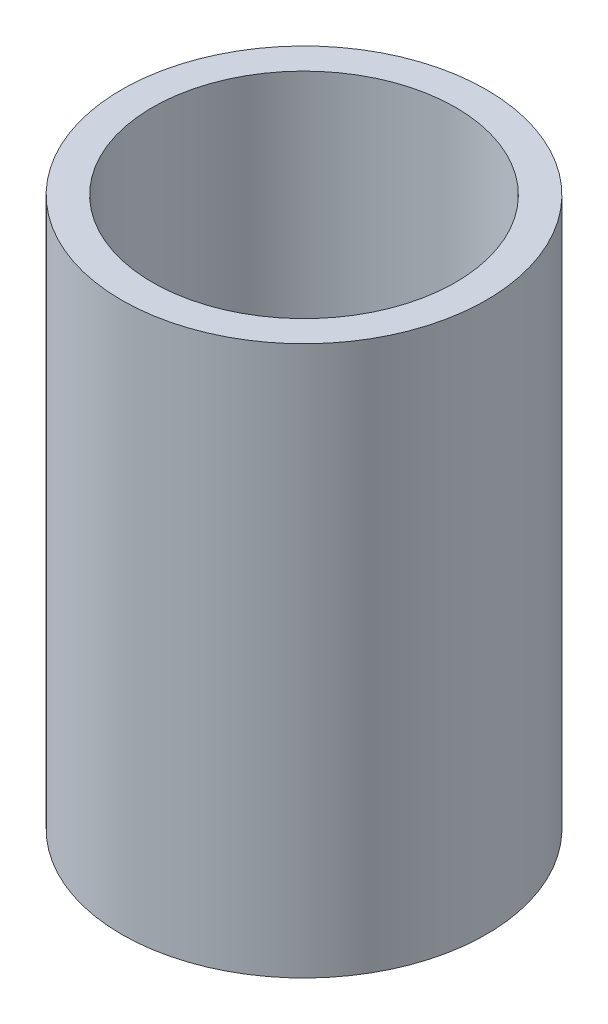
ISO-10303-21;
HEADER;
FILE_DESCRIPTION(('STEP AP214'),'2;1');
FILE_NAME('part.step','',(''),(''),'','','');
FILE_SCHEMA(('AUTOMOTIVE_DESIGN { 1 0 10303 214 1 1 1 1 }'));
ENDSEC;
DATA;
#1=APPLICATION_CONTEXT('core data for automotive mechanical design processes');
#2=APPLICATION_PROTOCOL_DEFINITION('international standard','automotive_design',2000,#1);
#3=PRODUCT_CONTEXT('',#1,'mechanical');
#4=PRODUCT('Part','Part','',(#3));
#5=PRODUCT_RELATED_PRODUCT_CATEGORY('part','',(#4));
#6=PRODUCT_DEFINITION_FORMATION('','',#4);
#7=PRODUCT_DEFINITION_CONTEXT('part definition',#1,'design');
#8=PRODUCT_DEFINITION('design','',#6,#7);
#9=PRODUCT_DEFINITION_SHAPE('','',#8);
#10=(LENGTH_UNIT() NAMED_UNIT(*) SI_UNIT(.MILLI.,.METRE.));
#11=(NAMED_UNIT(*) PLANE_ANGLE_UNIT() SI_UNIT($,.RADIAN.));
#12=(NAMED_UNIT(*) SI_UNIT($,.STERADIAN.) SOLID_ANGLE_UNIT());
#13=UNCERTAINTY_MEASURE_WITH_UNIT(LENGTH_MEASURE(1.E-05),#10,'distance_accuracy_value','');
#14=(GEOMETRIC_REPRESENTATION_CONTEXT(3) GLOBAL_UNCERTAINTY_ASSIGNED_CONTEXT((#13)) GLOBAL_UNIT_ASSIGNED_CONTEXT((#10,
#11,#12)) REPRESENTATION_CONTEXT('',''));
#15=CARTESIAN_POINT('',(0.,0.,0.));
#16=DIRECTION('',(0.,0.,1.));
#17=DIRECTION('',(1.,0.,0.));
#18=AXIS2_PLACEMENT_3D('',#15,#16,#17);
#19=CARTESIAN_POINT('',(0.,63.5,0.));
#20=DIRECTION('',(0.,1.,0.));
#21=DIRECTION('',(0.,0.,-1.));
#22=AXIS2_PLACEMENT_3D('',#19,#20,#21);
#23=PLANE('',#22);
#24=CARTESIAN_POINT('',(0.,63.5,0.));
#25=DIRECTION('',(0.,-1.,0.));
#26=DIRECTION('',(0.,0.,-1.));
#27=AXIS2_PLACEMENT_3D('',#24,#25,#26);
#28=CIRCLE('',#27,21.082);
#29=CARTESIAN_POINT('',(0.,63.5,-21.082));
#30=VERTEX_POINT('',#29);
#31=EDGE_CURVE('E10',#30,#30,#28,.T.);
#32=ORIENTED_EDGE('',*,*,#31,.F.);
#33=EDGE_LOOP('',(#32));
#34=FACE_BOUND('',#33,.T.);
#35=CARTESIAN_POINT('',(0.,63.5,0.));
#36=DIRECTION('',(0.,-1.,0.));
#37=DIRECTION('',(0.,0.,-1.));
#38=AXIS2_PLACEMENT_3D('',#35,#36,#37);
#39=CIRCLE('',#38,17.526);
#40=CARTESIAN_POINT('',(0.,63.5,-17.526));
#41=VERTEX_POINT('',#40);
#42=EDGE_CURVE('E57',#41,#41,#39,.T.);
#43=ORIENTED_EDGE('',*,*,#42,.T.);
#44=EDGE_LOOP('',(#43));
#45=FACE_BOUND('',#44,.T.);
#46=ADVANCED_FACE('F43',(#34,#45),#23,.T.);
#47=CARTESIAN_POINT('',(0.,0.,0.));
#48=DIRECTION('',(0.,1.,0.));
#49=DIRECTION('',(0.,0.,-1.));
#50=AXIS2_PLACEMENT_3D('',#47,#48,#49);
#51=PLANE('',#50);
#52=CARTESIAN_POINT('',(0.,0.,0.));
#53=DIRECTION('',(0.,-1.,0.));
#54=DIRECTION('',(0.,0.,-1.));
#55=AXIS2_PLACEMENT_3D('',#52,#53,#54);
#56=CIRCLE('',#55,21.082);
#57=CARTESIAN_POINT('',(0.,0.,-21.082));
#58=VERTEX_POINT('',#57);
#59=EDGE_CURVE('E47',#58,#58,#56,.T.);
#60=ORIENTED_EDGE('',*,*,#59,.T.);
#61=EDGE_LOOP('',(#60));
#62=FACE_BOUND('',#61,.T.);
#63=CARTESIAN_POINT('',(0.,0.,0.));
#64=DIRECTION('',(0.,-1.,0.));
#65=DIRECTION('',(0.,0.,-1.));
#66=AXIS2_PLACEMENT_3D('',#63,#64,#65);
#67=CIRCLE('',#66,17.526);
#68=CARTESIAN_POINT('',(0.,0.,-17.526));
#69=VERTEX_POINT('',#68);
#70=EDGE_CURVE('E59',#69,#69,#67,.T.);
#71=ORIENTED_EDGE('',*,*,#70,.F.);
#72=EDGE_LOOP('',(#71));
#73=FACE_BOUND('',#72,.T.);
#74=ADVANCED_FACE('F73',(#62,#73),#51,.F.);
#75=CARTESIAN_POINT('',(0.,63.5,0.));
#76=DIRECTION('',(0.,-1.,0.));
#77=DIRECTION('',(0.,0.,1.));
#78=AXIS2_PLACEMENT_3D('',#75,#76,#77);
#79=CYLINDRICAL_SURFACE('',#78,21.082);
#80=ORIENTED_EDGE('',*,*,#31,.T.);
#81=EDGE_LOOP('',(#80));
#82=FACE_BOUND('',#81,.T.);
#83=ORIENTED_EDGE('',*,*,#59,.F.);
#84=EDGE_LOOP('',(#83));
#85=FACE_BOUND('',#84,.T.);
#86=ADVANCED_FACE('F45',(#82,#85),#79,.T.);
#87=CARTESIAN_POINT('',(0.,63.5,0.));
#88=DIRECTION('',(0.,-1.,0.));
#89=DIRECTION('',(0.,0.,1.));
#90=AXIS2_PLACEMENT_3D('',#87,#88,#89);
#91=CYLINDRICAL_SURFACE('',#90,17.526);
#92=ORIENTED_EDGE('',*,*,#42,.F.);
#93=EDGE_LOOP('',(#92));
#94=FACE_BOUND('',#93,.T.);
#95=ORIENTED_EDGE('',*,*,#70,.T.);
#96=EDGE_LOOP('',(#95));
#97=FACE_BOUND('',#96,.T.);
#98=ADVANCED_FACE('F67',(#94,#97),#91,.F.);
#99=CLOSED_SHELL('',(#46,#74,#86,#98));
#100=MANIFOLD_SOLID_BREP('B2',#99);
#101=ADVANCED_BREP_SHAPE_REPRESENTATION('',(#18,#100),#14);
#102=SHAPE_DEFINITION_REPRESENTATION(#9,#101);
ENDSEC;
END-ISO-10303-21;
